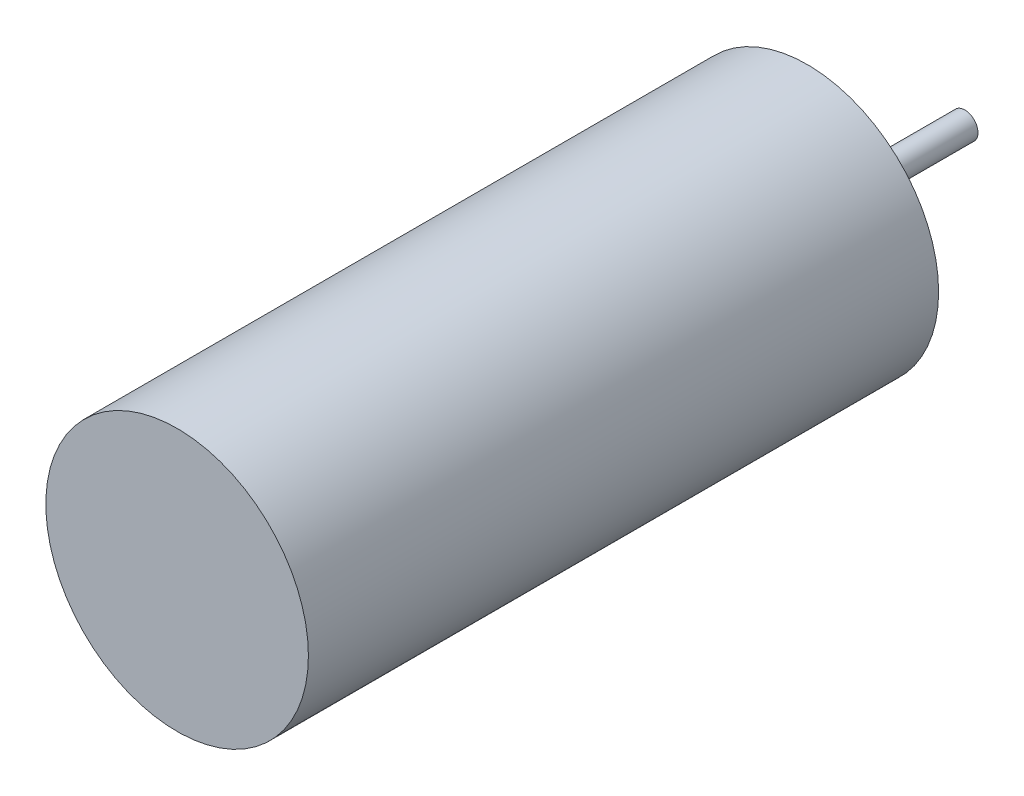
ISO-10303-21;
HEADER;
FILE_DESCRIPTION(('STEP AP214'),'2;1');
FILE_NAME('part.step','',(''),(''),'','','');
FILE_SCHEMA(('AUTOMOTIVE_DESIGN { 1 0 10303 214 1 1 1 1 }'));
ENDSEC;
DATA;
#1=APPLICATION_CONTEXT('core data for automotive mechanical design processes');
#2=APPLICATION_PROTOCOL_DEFINITION('international standard','automotive_design',2000,#1);
#3=PRODUCT_CONTEXT('',#1,'mechanical');
#4=PRODUCT('Part','Part','',(#3));
#5=PRODUCT_RELATED_PRODUCT_CATEGORY('part','',(#4));
#6=PRODUCT_DEFINITION_FORMATION('','',#4);
#7=PRODUCT_DEFINITION_CONTEXT('part definition',#1,'design');
#8=PRODUCT_DEFINITION('design','',#6,#7);
#9=PRODUCT_DEFINITION_SHAPE('','',#8);
#10=(LENGTH_UNIT() NAMED_UNIT(*) SI_UNIT(.MILLI.,.METRE.));
#11=(NAMED_UNIT(*) PLANE_ANGLE_UNIT() SI_UNIT($,.RADIAN.));
#12=(NAMED_UNIT(*) SI_UNIT($,.STERADIAN.) SOLID_ANGLE_UNIT());
#13=UNCERTAINTY_MEASURE_WITH_UNIT(LENGTH_MEASURE(1.E-05),#10,'distance_accuracy_value','');
#14=(GEOMETRIC_REPRESENTATION_CONTEXT(3) GLOBAL_UNCERTAINTY_ASSIGNED_CONTEXT((#13)) GLOBAL_UNIT_ASSIGNED_CONTEXT((#10,
#11,#12)) REPRESENTATION_CONTEXT('',''));
#15=CARTESIAN_POINT('',(0.,0.,0.));
#16=DIRECTION('',(0.,0.,1.));
#17=DIRECTION('',(1.,0.,0.));
#18=AXIS2_PLACEMENT_3D('',#15,#16,#17);
#19=CARTESIAN_POINT('',(0.,0.,12.));
#20=DIRECTION('',(0.,0.,-1.));
#21=DIRECTION('',(-1.,0.,0.));
#22=AXIS2_PLACEMENT_3D('',#19,#20,#21);
#23=CYLINDRICAL_SURFACE('',#22,2.5);
#24=CARTESIAN_POINT('',(0.,0.,12.));
#25=DIRECTION('',(0.,0.,1.));
#26=DIRECTION('',(1.,0.,0.));
#27=AXIS2_PLACEMENT_3D('',#24,#25,#26);
#28=CIRCLE('',#27,2.5);
#29=CARTESIAN_POINT('',(2.5,0.,12.));
#30=VERTEX_POINT('',#29);
#31=EDGE_CURVE('E38',#30,#30,#28,.T.);
#32=ORIENTED_EDGE('',*,*,#31,.F.);
#33=EDGE_LOOP('',(#32));
#34=FACE_BOUND('',#33,.T.);
#35=CARTESIAN_POINT('',(0.,0.,0.));
#36=DIRECTION('',(0.,0.,1.));
#37=DIRECTION('',(1.,0.,0.));
#38=AXIS2_PLACEMENT_3D('',#35,#36,#37);
#39=CIRCLE('',#38,2.5);
#40=CARTESIAN_POINT('',(2.5,0.,0.));
#41=VERTEX_POINT('',#40);
#42=EDGE_CURVE('E42',#41,#41,#39,.T.);
#43=ORIENTED_EDGE('',*,*,#42,.T.);
#44=EDGE_LOOP('',(#43));
#45=FACE_BOUND('',#44,.T.);
#46=ADVANCED_FACE('F32',(#34,#45),#23,.T.);
#47=CARTESIAN_POINT('',(0.,0.,12.));
#48=DIRECTION('',(0.,0.,1.));
#49=DIRECTION('',(1.,0.,0.));
#50=AXIS2_PLACEMENT_3D('',#47,#48,#49);
#51=PLANE('',#50);
#52=ORIENTED_EDGE('',*,*,#31,.T.);
#53=EDGE_LOOP('',(#52));
#54=FACE_BOUND('',#53,.T.);
#55=ADVANCED_FACE('F63',(#54),#51,.T.);
#56=CARTESIAN_POINT('',(0.,0.,0.));
#57=DIRECTION('',(0.,0.,1.));
#58=DIRECTION('',(1.,0.,0.));
#59=AXIS2_PLACEMENT_3D('',#56,#57,#58);
#60=PLANE('',#59);
#61=CARTESIAN_POINT('',(0.,0.,0.));
#62=DIRECTION('',(0.,0.,1.));
#63=DIRECTION('',(1.,0.,0.));
#64=AXIS2_PLACEMENT_3D('',#61,#62,#63);
#65=CIRCLE('',#64,0.25);
#66=CARTESIAN_POINT('',(0.25,0.,0.));
#67=VERTEX_POINT('',#66);
#68=EDGE_CURVE('E10',#67,#67,#65,.F.);
#69=ORIENTED_EDGE('',*,*,#68,.F.);
#70=EDGE_LOOP('',(#69));
#71=FACE_BOUND('',#70,.T.);
#72=ORIENTED_EDGE('',*,*,#42,.F.);
#73=EDGE_LOOP('',(#72));
#74=FACE_BOUND('',#73,.T.);
#75=ADVANCED_FACE('F56',(#71,#74),#60,.F.);
#76=CARTESIAN_POINT('',(0.,0.,-3.));
#77=DIRECTION('',(0.,0.,1.));
#78=DIRECTION('',(1.,0.,0.));
#79=AXIS2_PLACEMENT_3D('',#76,#77,#78);
#80=CYLINDRICAL_SURFACE('',#79,0.25);
#81=CARTESIAN_POINT('',(0.,0.,-3.));
#82=DIRECTION('',(0.,0.,-1.));
#83=DIRECTION('',(-1.,0.,0.));
#84=AXIS2_PLACEMENT_3D('',#81,#82,#83);
#85=CIRCLE('',#84,0.25);
#86=CARTESIAN_POINT('',(-0.25,0.,-3.));
#87=VERTEX_POINT('',#86);
#88=EDGE_CURVE('E47',#87,#87,#85,.T.);
#89=ORIENTED_EDGE('',*,*,#88,.F.);
#90=EDGE_LOOP('',(#89));
#91=FACE_BOUND('',#90,.T.);
#92=ORIENTED_EDGE('',*,*,#68,.T.);
#93=EDGE_LOOP('',(#92));
#94=FACE_BOUND('',#93,.T.);
#95=ADVANCED_FACE('F54',(#91,#94),#80,.T.);
#96=CARTESIAN_POINT('',(0.,0.,-3.));
#97=DIRECTION('',(0.,0.,-1.));
#98=DIRECTION('',(-1.,0.,0.));
#99=AXIS2_PLACEMENT_3D('',#96,#97,#98);
#100=PLANE('',#99);
#101=ORIENTED_EDGE('',*,*,#88,.T.);
#102=EDGE_LOOP('',(#101));
#103=FACE_BOUND('',#102,.T.);
#104=ADVANCED_FACE('F52',(#103),#100,.T.);
#105=CLOSED_SHELL('',(#46,#55,#75,#95,#104));
#106=MANIFOLD_SOLID_BREP('B2',#105);
#107=ADVANCED_BREP_SHAPE_REPRESENTATION('',(#18,#106),#14);
#108=SHAPE_DEFINITION_REPRESENTATION(#9,#107);
ENDSEC;
END-ISO-10303-21;
